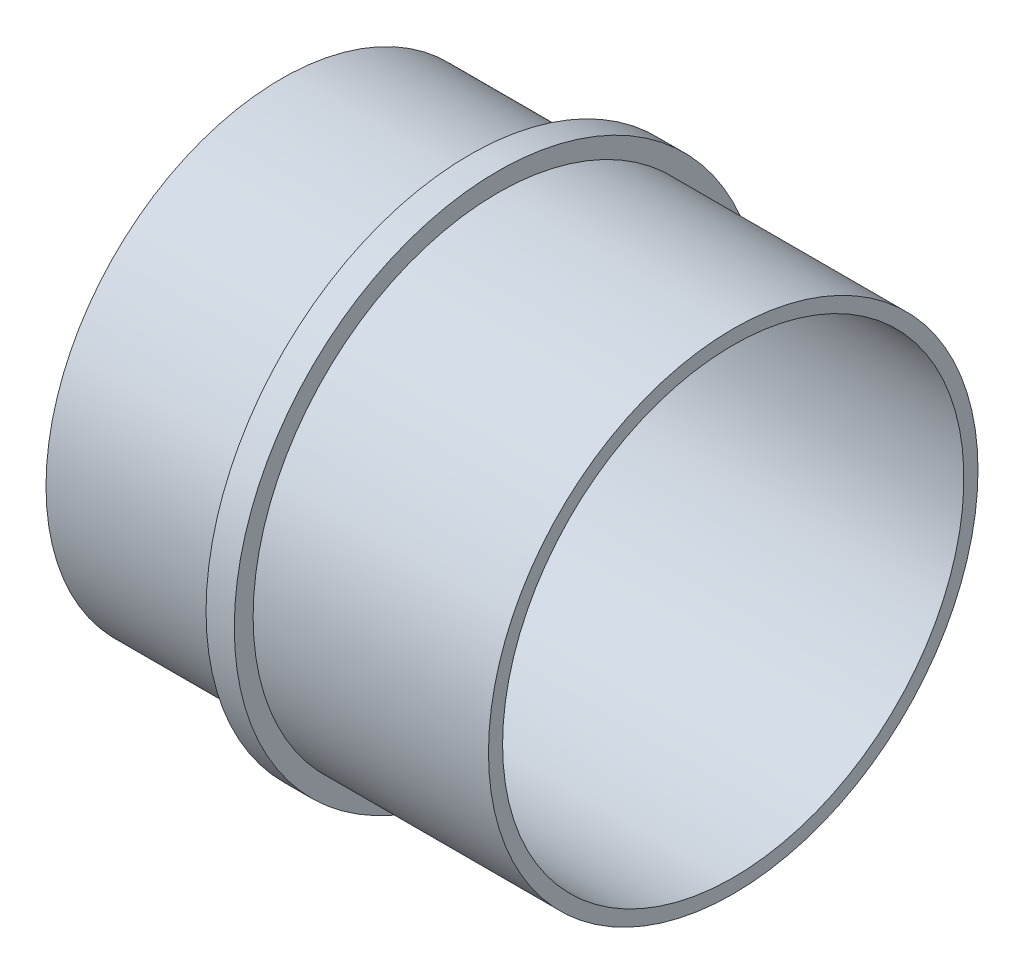
ISO-10303-21;
HEADER;
FILE_DESCRIPTION(('STEP AP214'),'2;1');
FILE_NAME('part.step','',(''),(''),'','','');
FILE_SCHEMA(('AUTOMOTIVE_DESIGN { 1 0 10303 214 1 1 1 1 }'));
ENDSEC;
DATA;
#1=APPLICATION_CONTEXT('core data for automotive mechanical design processes');
#2=APPLICATION_PROTOCOL_DEFINITION('international standard','automotive_design',2000,#1);
#3=PRODUCT_CONTEXT('',#1,'mechanical');
#4=PRODUCT('Part','Part','',(#3));
#5=PRODUCT_RELATED_PRODUCT_CATEGORY('part','',(#4));
#6=PRODUCT_DEFINITION_FORMATION('','',#4);
#7=PRODUCT_DEFINITION_CONTEXT('part definition',#1,'design');
#8=PRODUCT_DEFINITION('design','',#6,#7);
#9=PRODUCT_DEFINITION_SHAPE('','',#8);
#10=(LENGTH_UNIT() NAMED_UNIT(*) SI_UNIT(.MILLI.,.METRE.));
#11=(NAMED_UNIT(*) PLANE_ANGLE_UNIT() SI_UNIT($,.RADIAN.));
#12=(NAMED_UNIT(*) SI_UNIT($,.STERADIAN.) SOLID_ANGLE_UNIT());
#13=UNCERTAINTY_MEASURE_WITH_UNIT(LENGTH_MEASURE(1.E-05),#10,'distance_accuracy_value','');
#14=(GEOMETRIC_REPRESENTATION_CONTEXT(3) GLOBAL_UNCERTAINTY_ASSIGNED_CONTEXT((#13)) GLOBAL_UNIT_ASSIGNED_CONTEXT((#10,
#11,#12)) REPRESENTATION_CONTEXT('',''));
#15=CARTESIAN_POINT('',(0.,0.,0.));
#16=DIRECTION('',(0.,0.,1.));
#17=DIRECTION('',(1.,0.,0.));
#18=AXIS2_PLACEMENT_3D('',#15,#16,#17);
#19=CARTESIAN_POINT('',(0.,0.249999999999999,0.));
#20=DIRECTION('',(1.,0.,0.));
#21=DIRECTION('',(0.,0.,-1.));
#22=AXIS2_PLACEMENT_3D('',#19,#20,#21);
#23=PLANE('',#22);
#24=CARTESIAN_POINT('',(0.,-12.25,0.));
#25=DIRECTION('',(-1.,0.,0.));
#26=DIRECTION('',(0.,0.,1.));
#27=AXIS2_PLACEMENT_3D('',#24,#25,#26);
#28=CIRCLE('',#27,12.25);
#29=CARTESIAN_POINT('',(0.,-12.25,12.25));
#30=VERTEX_POINT('',#29);
#31=EDGE_CURVE('E10',#30,#30,#28,.T.);
#32=ORIENTED_EDGE('',*,*,#31,.F.);
#33=EDGE_LOOP('',(#32));
#34=FACE_BOUND('',#33,.T.);
#35=CARTESIAN_POINT('',(0.,-12.25,0.));
#36=DIRECTION('',(-1.,0.,0.));
#37=DIRECTION('',(0.,0.,1.));
#38=AXIS2_PLACEMENT_3D('',#35,#36,#37);
#39=CIRCLE('',#38,12.5);
#40=CARTESIAN_POINT('',(0.,-12.25,12.5));
#41=VERTEX_POINT('',#40);
#42=EDGE_CURVE('E59',#41,#41,#39,.T.);
#43=ORIENTED_EDGE('',*,*,#42,.T.);
#44=EDGE_LOOP('',(#43));
#45=FACE_BOUND('',#44,.T.);
#46=ADVANCED_FACE('F31',(#34,#45),#23,.F.);
#47=CARTESIAN_POINT('',(-3.,-12.25,0.));
#48=DIRECTION('',(-1.,0.,0.));
#49=DIRECTION('',(0.,0.,1.));
#50=AXIS2_PLACEMENT_3D('',#47,#48,#49);
#51=CYLINDRICAL_SURFACE('',#50,12.25);
#52=CARTESIAN_POINT('',(24.,-12.25,0.));
#53=DIRECTION('',(-1.,0.,0.));
#54=DIRECTION('',(0.,0.,1.));
#55=AXIS2_PLACEMENT_3D('',#52,#53,#54);
#56=CIRCLE('',#55,12.25);
#57=CARTESIAN_POINT('',(24.,-12.25,12.25));
#58=VERTEX_POINT('',#57);
#59=EDGE_CURVE('E37',#58,#58,#56,.T.);
#60=ORIENTED_EDGE('',*,*,#59,.F.);
#61=EDGE_LOOP('',(#60));
#62=FACE_BOUND('',#61,.T.);
#63=ORIENTED_EDGE('',*,*,#31,.T.);
#64=EDGE_LOOP('',(#63));
#65=FACE_BOUND('',#64,.T.);
#66=ADVANCED_FACE('F96',(#62,#65),#51,.F.);
#67=CARTESIAN_POINT('',(24.,0.,0.));
#68=DIRECTION('',(-1.,0.,0.));
#69=DIRECTION('',(0.,0.,1.));
#70=AXIS2_PLACEMENT_3D('',#67,#68,#69);
#71=PLANE('',#70);
#72=CARTESIAN_POINT('',(24.,-12.25,0.));
#73=DIRECTION('',(-1.,0.,0.));
#74=DIRECTION('',(0.,0.,1.));
#75=AXIS2_PLACEMENT_3D('',#72,#73,#74);
#76=CIRCLE('',#75,13.);
#77=CARTESIAN_POINT('',(24.,-12.25,13.));
#78=VERTEX_POINT('',#77);
#79=EDGE_CURVE('E41',#78,#78,#76,.T.);
#80=ORIENTED_EDGE('',*,*,#79,.F.);
#81=EDGE_LOOP('',(#80));
#82=FACE_BOUND('',#81,.T.);
#83=ORIENTED_EDGE('',*,*,#59,.T.);
#84=EDGE_LOOP('',(#83));
#85=FACE_BOUND('',#84,.T.);
#86=ADVANCED_FACE('F91',(#82,#85),#71,.F.);
#87=CARTESIAN_POINT('',(-3.,-12.25,0.));
#88=DIRECTION('',(-1.,0.,0.));
#89=DIRECTION('',(0.,0.,1.));
#90=AXIS2_PLACEMENT_3D('',#87,#88,#89);
#91=CYLINDRICAL_SURFACE('',#90,13.);
#92=CARTESIAN_POINT('',(11.5,-12.25,0.));
#93=DIRECTION('',(-1.,0.,0.));
#94=DIRECTION('',(0.,0.,1.));
#95=AXIS2_PLACEMENT_3D('',#92,#93,#94);
#96=CIRCLE('',#95,13.);
#97=CARTESIAN_POINT('',(11.5,-12.25,13.));
#98=VERTEX_POINT('',#97);
#99=EDGE_CURVE('E45',#98,#98,#96,.T.);
#100=ORIENTED_EDGE('',*,*,#99,.F.);
#101=EDGE_LOOP('',(#100));
#102=FACE_BOUND('',#101,.T.);
#103=ORIENTED_EDGE('',*,*,#79,.T.);
#104=EDGE_LOOP('',(#103));
#105=FACE_BOUND('',#104,.T.);
#106=ADVANCED_FACE('F85',(#102,#105),#91,.T.);
#107=CARTESIAN_POINT('',(11.5,0.749999999999998,0.));
#108=DIRECTION('',(-1.,0.,0.));
#109=DIRECTION('',(0.,0.,1.));
#110=AXIS2_PLACEMENT_3D('',#107,#108,#109);
#111=PLANE('',#110);
#112=CARTESIAN_POINT('',(11.5,-12.25,0.));
#113=DIRECTION('',(-1.,0.,0.));
#114=DIRECTION('',(0.,0.,1.));
#115=AXIS2_PLACEMENT_3D('',#112,#113,#114);
#116=CIRCLE('',#115,14.);
#117=CARTESIAN_POINT('',(11.5,-12.25,14.));
#118=VERTEX_POINT('',#117);
#119=EDGE_CURVE('E50',#118,#118,#116,.T.);
#120=ORIENTED_EDGE('',*,*,#119,.F.);
#121=EDGE_LOOP('',(#120));
#122=FACE_BOUND('',#121,.T.);
#123=ORIENTED_EDGE('',*,*,#99,.T.);
#124=EDGE_LOOP('',(#123));
#125=FACE_BOUND('',#124,.T.);
#126=ADVANCED_FACE('F79',(#122,#125),#111,.F.);
#127=CARTESIAN_POINT('',(-3.,-12.25,0.));
#128=DIRECTION('',(-1.,0.,0.));
#129=DIRECTION('',(0.,0.,1.));
#130=AXIS2_PLACEMENT_3D('',#127,#128,#129);
#131=CYLINDRICAL_SURFACE('',#130,14.);
#132=CARTESIAN_POINT('',(10.,-12.25,0.));
#133=DIRECTION('',(-1.,0.,0.));
#134=DIRECTION('',(0.,0.,1.));
#135=AXIS2_PLACEMENT_3D('',#132,#133,#134);
#136=CIRCLE('',#135,14.);
#137=CARTESIAN_POINT('',(10.,-12.25,14.));
#138=VERTEX_POINT('',#137);
#139=EDGE_CURVE('E53',#138,#138,#136,.T.);
#140=ORIENTED_EDGE('',*,*,#139,.F.);
#141=EDGE_LOOP('',(#140));
#142=FACE_BOUND('',#141,.T.);
#143=ORIENTED_EDGE('',*,*,#119,.T.);
#144=EDGE_LOOP('',(#143));
#145=FACE_BOUND('',#144,.T.);
#146=ADVANCED_FACE('F73',(#142,#145),#131,.T.);
#147=CARTESIAN_POINT('',(10.,1.75,0.));
#148=DIRECTION('',(1.,0.,0.));
#149=DIRECTION('',(0.,0.,-1.));
#150=AXIS2_PLACEMENT_3D('',#147,#148,#149);
#151=PLANE('',#150);
#152=CARTESIAN_POINT('',(10.,-12.25,0.));
#153=DIRECTION('',(-1.,0.,0.));
#154=DIRECTION('',(0.,0.,1.));
#155=AXIS2_PLACEMENT_3D('',#152,#153,#154);
#156=CIRCLE('',#155,12.5);
#157=CARTESIAN_POINT('',(10.,-12.25,12.5));
#158=VERTEX_POINT('',#157);
#159=EDGE_CURVE('E56',#158,#158,#156,.T.);
#160=ORIENTED_EDGE('',*,*,#159,.F.);
#161=EDGE_LOOP('',(#160));
#162=FACE_BOUND('',#161,.T.);
#163=ORIENTED_EDGE('',*,*,#139,.T.);
#164=EDGE_LOOP('',(#163));
#165=FACE_BOUND('',#164,.T.);
#166=ADVANCED_FACE('F67',(#162,#165),#151,.F.);
#167=CARTESIAN_POINT('',(-3.,-12.25,0.));
#168=DIRECTION('',(-1.,0.,0.));
#169=DIRECTION('',(0.,0.,1.));
#170=AXIS2_PLACEMENT_3D('',#167,#168,#169);
#171=CYLINDRICAL_SURFACE('',#170,12.5);
#172=ORIENTED_EDGE('',*,*,#42,.F.);
#173=EDGE_LOOP('',(#172));
#174=FACE_BOUND('',#173,.T.);
#175=ORIENTED_EDGE('',*,*,#159,.T.);
#176=EDGE_LOOP('',(#175));
#177=FACE_BOUND('',#176,.T.);
#178=ADVANCED_FACE('F64',(#174,#177),#171,.T.);
#179=CLOSED_SHELL('',(#46,#66,#86,#106,#126,#146,#166,#178));
#180=MANIFOLD_SOLID_BREP('B2',#179);
#181=ADVANCED_BREP_SHAPE_REPRESENTATION('',(#18,#180),#14);
#182=SHAPE_DEFINITION_REPRESENTATION(#9,#181);
ENDSEC;
END-ISO-10303-21;
